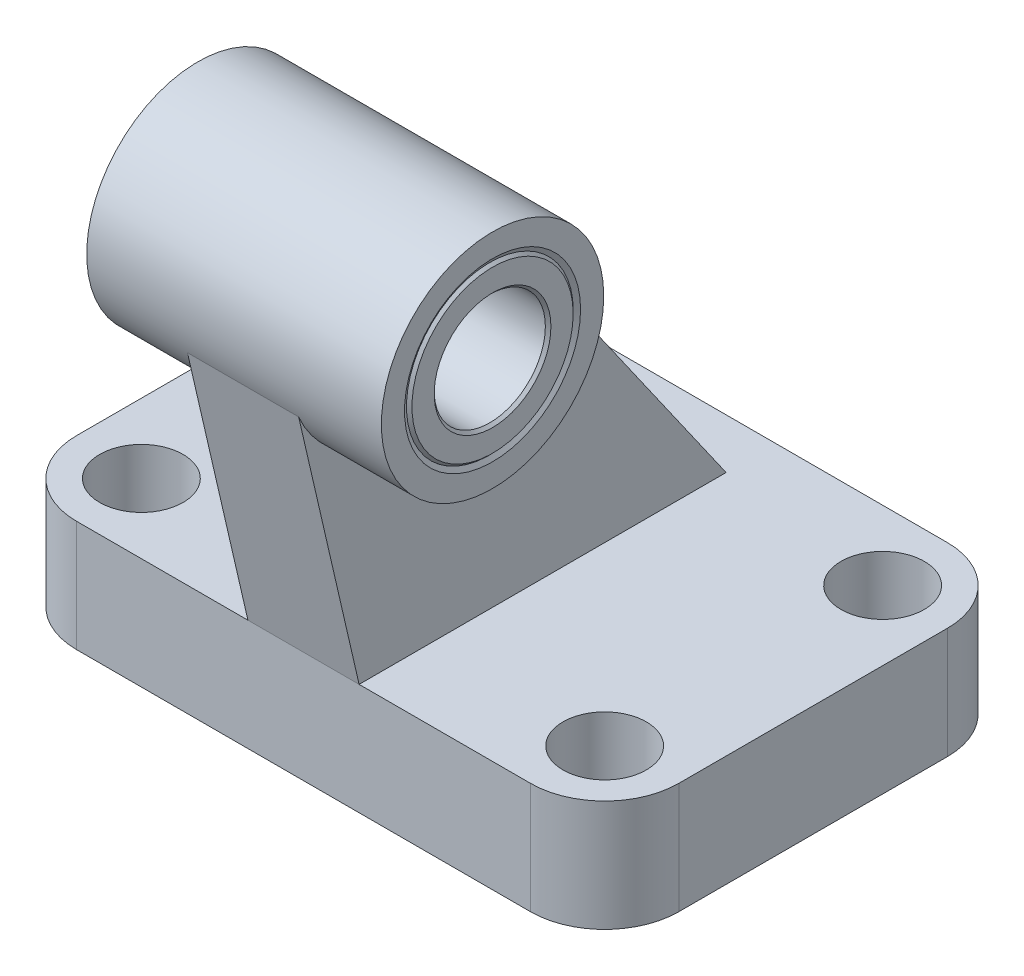
ISO-10303-21;
HEADER;
FILE_DESCRIPTION(('STEP AP214'),'2;1');
FILE_NAME('part.step','',(''),(''),'','','');
FILE_SCHEMA(('AUTOMOTIVE_DESIGN { 1 0 10303 214 1 1 1 1 }'));
ENDSEC;
DATA;
#1=APPLICATION_CONTEXT('core data for automotive mechanical design processes');
#2=APPLICATION_PROTOCOL_DEFINITION('international standard','automotive_design',2000,#1);
#3=PRODUCT_CONTEXT('',#1,'mechanical');
#4=PRODUCT('Part','Part','',(#3));
#5=PRODUCT_RELATED_PRODUCT_CATEGORY('part','',(#4));
#6=PRODUCT_DEFINITION_FORMATION('','',#4);
#7=PRODUCT_DEFINITION_CONTEXT('part definition',#1,'design');
#8=PRODUCT_DEFINITION('design','',#6,#7);
#9=PRODUCT_DEFINITION_SHAPE('','',#8);
#10=(LENGTH_UNIT() NAMED_UNIT(*) SI_UNIT(.MILLI.,.METRE.));
#11=(NAMED_UNIT(*) PLANE_ANGLE_UNIT() SI_UNIT($,.RADIAN.));
#12=(NAMED_UNIT(*) SI_UNIT($,.STERADIAN.) SOLID_ANGLE_UNIT());
#13=UNCERTAINTY_MEASURE_WITH_UNIT(LENGTH_MEASURE(1.E-05),#10,'distance_accuracy_value','');
#14=(GEOMETRIC_REPRESENTATION_CONTEXT(3) GLOBAL_UNCERTAINTY_ASSIGNED_CONTEXT((#13)) GLOBAL_UNIT_ASSIGNED_CONTEXT((#10,
#11,#12)) REPRESENTATION_CONTEXT('',''));
#15=CARTESIAN_POINT('',(0.,0.,0.));
#16=DIRECTION('',(0.,0.,1.));
#17=DIRECTION('',(1.,0.,0.));
#18=AXIS2_PLACEMENT_3D('',#15,#16,#17);
#19=CARTESIAN_POINT('',(15.9,45.,18.));
#20=DIRECTION('',(1.,0.,0.));
#21=DIRECTION('',(0.,0.,-1.));
#22=AXIS2_PLACEMENT_3D('',#19,#20,#21);
#23=CYLINDRICAL_SURFACE('',#22,9.);
#24=CARTESIAN_POINT('',(15.6,45.,18.));
#25=DIRECTION('',(1.,0.,0.));
#26=DIRECTION('',(0.,0.,-1.));
#27=AXIS2_PLACEMENT_3D('',#24,#25,#26);
#28=CIRCLE('',#27,9.);
#29=CARTESIAN_POINT('',(15.6,45.,9.));
#30=VERTEX_POINT('',#29);
#31=EDGE_CURVE('E512',#30,#30,#28,.T.);
#32=ORIENTED_EDGE('',*,*,#31,.F.);
#33=EDGE_LOOP('',(#32));
#34=FACE_BOUND('',#33,.T.);
#35=CARTESIAN_POINT('',(15.6113248654052,45.,18.));
#36=DIRECTION('',(1.,0.,0.));
#37=DIRECTION('',(0.,0.,-1.));
#38=AXIS2_PLACEMENT_3D('',#35,#36,#37);
#39=CIRCLE('',#38,9.);
#40=CARTESIAN_POINT('',(15.6113248654052,45.,9.));
#41=VERTEX_POINT('',#40);
#42=EDGE_CURVE('E303',#41,#41,#39,.T.);
#43=ORIENTED_EDGE('',*,*,#42,.T.);
#44=EDGE_LOOP('',(#43));
#45=FACE_BOUND('',#44,.T.);
#46=ADVANCED_FACE('F32',(#34,#45),#23,.F.);
#47=CARTESIAN_POINT('',(6.,42.3437666836608,29.5054105261929));
#48=DIRECTION('',(0.,0.224951054343865,-0.974370064785235));
#49=DIRECTION('',(0.,0.974370064785235,0.224951054343865));
#50=AXIS2_PLACEMENT_3D('',#47,#48,#49);
#51=PLANE('',#50);
#52=DIRECTION('',(-1.,0.,0.));
#53=VECTOR('',#52,1.);
#54=CARTESIAN_POINT('',(15.9,40.2608120616612,29.0245225604152));
#55=LINE('',#54,#53);
#56=CARTESIAN_POINT('',(-6.,40.2608120616613,29.0245225604152));
#57=VERTEX_POINT('',#56);
#58=CARTESIAN_POINT('',(6.,40.2608120616613,29.0245225604152));
#59=VERTEX_POINT('',#58);
#60=EDGE_CURVE('E132',#57,#59,#55,.F.);
#61=ORIENTED_EDGE('',*,*,#60,.F.);
#62=DIRECTION('',(0.,-0.974370064785235,-0.224951054343865));
#63=VECTOR('',#62,1.);
#64=CARTESIAN_POINT('',(-6.,42.3437666836608,29.5054105261929));
#65=LINE('',#64,#63);
#66=CARTESIAN_POINT('',(-6.,12.,22.5));
#67=VERTEX_POINT('',#66);
#68=EDGE_CURVE('E122',#57,#67,#65,.T.);
#69=ORIENTED_EDGE('',*,*,#68,.T.);
#70=DIRECTION('',(-1.,0.,0.));
#71=VECTOR('',#70,1.);
#72=CARTESIAN_POINT('',(6.,12.,22.5));
#73=LINE('',#72,#71);
#74=CARTESIAN_POINT('',(6.,12.,22.5));
#75=VERTEX_POINT('',#74);
#76=EDGE_CURVE('E159',#75,#67,#73,.T.);
#77=ORIENTED_EDGE('',*,*,#76,.F.);
#78=DIRECTION('',(0.,-0.974370064785235,-0.224951054343865));
#79=VECTOR('',#78,1.);
#80=CARTESIAN_POINT('',(6.,42.3437666836608,29.5054105261929));
#81=LINE('',#80,#79);
#82=EDGE_CURVE('E134',#59,#75,#81,.T.);
#83=ORIENTED_EDGE('',*,*,#82,.F.);
#84=EDGE_LOOP('',(#61,#69,#77,#83));
#85=FACE_BOUND('',#84,.T.);
#86=ADVANCED_FACE('F133',(#85),#51,.F.);
#87=CARTESIAN_POINT('',(6.,12.,-17.1068487609204));
#88=DIRECTION('',(0.,-0.573576436351046,0.819152044288992));
#89=DIRECTION('',(0.,-0.819152044288992,-0.573576436351046));
#90=AXIS2_PLACEMENT_3D('',#87,#88,#89);
#91=PLANE('',#90);
#92=DIRECTION('',(-1.,0.,0.));
#93=VECTOR('',#92,1.);
#94=CARTESIAN_POINT('',(15.9,45.,6.));
#95=LINE('',#94,#93);
#96=CARTESIAN_POINT('',(6.,45.,6.));
#97=VERTEX_POINT('',#96);
#98=CARTESIAN_POINT('',(-6.,45.,6.));
#99=VERTEX_POINT('',#98);
#100=EDGE_CURVE('E47',#97,#99,#95,.T.);
#101=ORIENTED_EDGE('',*,*,#100,.F.);
#102=DIRECTION('',(0.,0.819152044288992,0.573576436351046));
#103=VECTOR('',#102,1.);
#104=CARTESIAN_POINT('',(6.,12.,-17.1068487609204));
#105=LINE('',#104,#103);
#106=CARTESIAN_POINT('',(6.,12.,-17.1068487609204));
#107=VERTEX_POINT('',#106);
#108=EDGE_CURVE('E154',#107,#97,#105,.T.);
#109=ORIENTED_EDGE('',*,*,#108,.F.);
#110=DIRECTION('',(-1.,0.,0.));
#111=VECTOR('',#110,1.);
#112=CARTESIAN_POINT('',(6.,12.,-17.1068487609204));
#113=LINE('',#112,#111);
#114=CARTESIAN_POINT('',(-6.,12.,-17.1068487609204));
#115=VERTEX_POINT('',#114);
#116=EDGE_CURVE('E156',#107,#115,#113,.T.);
#117=ORIENTED_EDGE('',*,*,#116,.T.);
#118=DIRECTION('',(0.,0.819152044288992,0.573576436351046));
#119=VECTOR('',#118,1.);
#120=CARTESIAN_POINT('',(-6.,12.,-17.1068487609204));
#121=LINE('',#120,#119);
#122=EDGE_CURVE('E148',#115,#99,#121,.T.);
#123=ORIENTED_EDGE('',*,*,#122,.T.);
#124=EDGE_LOOP('',(#101,#109,#117,#123));
#125=FACE_BOUND('',#124,.T.);
#126=ADVANCED_FACE('F276',(#125),#91,.F.);
#127=CARTESIAN_POINT('',(-24.5000000000001,12.,14.5000000000001));
#128=DIRECTION('',(0.,1.,0.));
#129=DIRECTION('',(0.,0.,1.));
#130=AXIS2_PLACEMENT_3D('',#127,#128,#129);
#131=PLANE('',#130);
#132=CARTESIAN_POINT('',(25.,12.,-15.));
#133=DIRECTION('',(0.,1.,0.));
#134=DIRECTION('',(0.,0.,1.));
#135=AXIS2_PLACEMENT_3D('',#132,#133,#134);
#136=CIRCLE('',#135,4.5);
#137=CARTESIAN_POINT('',(25.,12.,-10.5));
#138=VERTEX_POINT('',#137);
#139=EDGE_CURVE('E306',#138,#138,#136,.T.);
#140=ORIENTED_EDGE('',*,*,#139,.F.);
#141=EDGE_LOOP('',(#140));
#142=FACE_BOUND('',#141,.T.);
#143=CARTESIAN_POINT('',(-25.,12.,-15.));
#144=DIRECTION('',(0.,1.,0.));
#145=DIRECTION('',(0.,0.,1.));
#146=AXIS2_PLACEMENT_3D('',#143,#144,#145);
#147=CIRCLE('',#146,4.5);
#148=CARTESIAN_POINT('',(-25.,12.,-10.5));
#149=VERTEX_POINT('',#148);
#150=EDGE_CURVE('E318',#149,#149,#147,.T.);
#151=ORIENTED_EDGE('',*,*,#150,.F.);
#152=EDGE_LOOP('',(#151));
#153=FACE_BOUND('',#152,.T.);
#154=CARTESIAN_POINT('',(25.,12.,15.));
#155=DIRECTION('',(0.,1.,0.));
#156=DIRECTION('',(0.,0.,1.));
#157=AXIS2_PLACEMENT_3D('',#154,#155,#156);
#158=CIRCLE('',#157,4.5);
#159=CARTESIAN_POINT('',(25.,12.,19.5));
#160=VERTEX_POINT('',#159);
#161=EDGE_CURVE('E324',#160,#160,#158,.T.);
#162=ORIENTED_EDGE('',*,*,#161,.F.);
#163=EDGE_LOOP('',(#162));
#164=FACE_BOUND('',#163,.T.);
#165=CARTESIAN_POINT('',(-25.,12.,15.));
#166=DIRECTION('',(0.,1.,0.));
#167=DIRECTION('',(0.,0.,1.));
#168=AXIS2_PLACEMENT_3D('',#165,#166,#167);
#169=CIRCLE('',#168,4.5);
#170=CARTESIAN_POINT('',(-25.,12.,19.5));
#171=VERTEX_POINT('',#170);
#172=EDGE_CURVE('E330',#171,#171,#169,.T.);
#173=ORIENTED_EDGE('',*,*,#172,.F.);
#174=EDGE_LOOP('',(#173));
#175=FACE_BOUND('',#174,.T.);
#176=DIRECTION('',(1.,0.,0.));
#177=VECTOR('',#176,1.);
#178=CARTESIAN_POINT('',(-24.5,12.,22.5));
#179=LINE('',#178,#177);
#180=CARTESIAN_POINT('',(-24.5,12.,22.5));
#181=VERTEX_POINT('',#180);
#182=EDGE_CURVE('E167',#181,#67,#179,.T.);
#183=ORIENTED_EDGE('',*,*,#182,.T.);
#184=DIRECTION('',(0.,0.,-1.));
#185=VECTOR('',#184,1.);
#186=CARTESIAN_POINT('',(-6.,12.,22.5));
#187=LINE('',#186,#185);
#188=EDGE_CURVE('E126',#67,#115,#187,.T.);
#189=ORIENTED_EDGE('',*,*,#188,.T.);
#190=ORIENTED_EDGE('',*,*,#116,.F.);
#191=DIRECTION('',(0.,0.,-1.));
#192=VECTOR('',#191,1.);
#193=CARTESIAN_POINT('',(6.,12.,22.5));
#194=LINE('',#193,#192);
#195=EDGE_CURVE('E151',#75,#107,#194,.T.);
#196=ORIENTED_EDGE('',*,*,#195,.F.);
#197=CARTESIAN_POINT('',(24.5,12.,22.5));
#198=VERTEX_POINT('',#197);
#199=EDGE_CURVE('E165',#75,#198,#179,.T.);
#200=ORIENTED_EDGE('',*,*,#199,.T.);
#201=CARTESIAN_POINT('',(24.5000000000001,12.,14.5000000000001));
#202=DIRECTION('',(0.,1.,0.));
#203=DIRECTION('',(0.,0.,1.));
#204=AXIS2_PLACEMENT_3D('',#201,#202,#203);
#205=CIRCLE('',#204,7.99999999999993);
#206=CARTESIAN_POINT('',(32.5,12.,14.5));
#207=VERTEX_POINT('',#206);
#208=EDGE_CURVE('E170',#198,#207,#205,.T.);
#209=ORIENTED_EDGE('',*,*,#208,.T.);
#210=DIRECTION('',(0.,0.,-1.));
#211=VECTOR('',#210,1.);
#212=CARTESIAN_POINT('',(32.5,12.,14.5));
#213=LINE('',#212,#211);
#214=CARTESIAN_POINT('',(32.5,12.,-14.5));
#215=VERTEX_POINT('',#214);
#216=EDGE_CURVE('E172',#207,#215,#213,.T.);
#217=ORIENTED_EDGE('',*,*,#216,.T.);
#218=CARTESIAN_POINT('',(24.5000000000001,12.,-14.5000000000001));
#219=DIRECTION('',(0.,1.,0.));
#220=DIRECTION('',(0.,0.,1.));
#221=AXIS2_PLACEMENT_3D('',#218,#219,#220);
#222=CIRCLE('',#221,7.99999999999993);
#223=CARTESIAN_POINT('',(24.5,12.,-22.5));
#224=VERTEX_POINT('',#223);
#225=EDGE_CURVE('E174',#215,#224,#222,.T.);
#226=ORIENTED_EDGE('',*,*,#225,.T.);
#227=DIRECTION('',(-1.,0.,0.));
#228=VECTOR('',#227,1.);
#229=CARTESIAN_POINT('',(24.5,12.,-22.5));
#230=LINE('',#229,#228);
#231=CARTESIAN_POINT('',(-24.5,12.,-22.5));
#232=VERTEX_POINT('',#231);
#233=EDGE_CURVE('E176',#224,#232,#230,.T.);
#234=ORIENTED_EDGE('',*,*,#233,.T.);
#235=CARTESIAN_POINT('',(-24.5000000000001,12.,-14.5000000000001));
#236=DIRECTION('',(0.,1.,0.));
#237=DIRECTION('',(0.,0.,1.));
#238=AXIS2_PLACEMENT_3D('',#235,#236,#237);
#239=CIRCLE('',#238,7.99999999999993);
#240=CARTESIAN_POINT('',(-32.5,12.,-14.5));
#241=VERTEX_POINT('',#240);
#242=EDGE_CURVE('E178',#232,#241,#239,.T.);
#243=ORIENTED_EDGE('',*,*,#242,.T.);
#244=DIRECTION('',(0.,0.,1.));
#245=VECTOR('',#244,1.);
#246=CARTESIAN_POINT('',(-32.5,12.,-14.5));
#247=LINE('',#246,#245);
#248=CARTESIAN_POINT('',(-32.5,12.,14.5));
#249=VERTEX_POINT('',#248);
#250=EDGE_CURVE('E180',#241,#249,#247,.T.);
#251=ORIENTED_EDGE('',*,*,#250,.T.);
#252=CARTESIAN_POINT('',(-24.5000000000001,12.,14.5000000000001));
#253=DIRECTION('',(0.,1.,0.));
#254=DIRECTION('',(0.,0.,1.));
#255=AXIS2_PLACEMENT_3D('',#252,#253,#254);
#256=CIRCLE('',#255,7.99999999999993);
#257=EDGE_CURVE('E162',#249,#181,#256,.T.);
#258=ORIENTED_EDGE('',*,*,#257,.T.);
#259=EDGE_LOOP('',(#183,#189,#190,#196,#200,#209,#217,#226,#234,#243,#251,#258));
#260=FACE_BOUND('',#259,.T.);
#261=ADVANCED_FACE('F243',(#142,#153,#164,#175,#260),#131,.T.);
#262=CARTESIAN_POINT('',(-24.5000000000001,12.,14.5000000000001));
#263=DIRECTION('',(0.,-1.,0.));
#264=DIRECTION('',(0.,0.,-1.));
#265=AXIS2_PLACEMENT_3D('',#262,#263,#264);
#266=CYLINDRICAL_SURFACE('',#265,7.99999999999993);
#267=CARTESIAN_POINT('',(-24.5000000000001,0.,14.5000000000001));
#268=DIRECTION('',(0.,1.,0.));
#269=DIRECTION('',(0.,0.,1.));
#270=AXIS2_PLACEMENT_3D('',#267,#268,#269);
#271=CIRCLE('',#270,7.99999999999993);
#272=CARTESIAN_POINT('',(-32.5,0.,14.5));
#273=VERTEX_POINT('',#272);
#274=CARTESIAN_POINT('',(-24.5,0.,22.5));
#275=VERTEX_POINT('',#274);
#276=EDGE_CURVE('E161',#273,#275,#271,.T.);
#277=ORIENTED_EDGE('',*,*,#276,.T.);
#278=DIRECTION('',(0.,-1.,0.));
#279=VECTOR('',#278,1.);
#280=CARTESIAN_POINT('',(-24.5,12.,22.5));
#281=LINE('',#280,#279);
#282=EDGE_CURVE('E40',#181,#275,#281,.T.);
#283=ORIENTED_EDGE('',*,*,#282,.F.);
#284=ORIENTED_EDGE('',*,*,#257,.F.);
#285=DIRECTION('',(0.,-1.,0.));
#286=VECTOR('',#285,1.);
#287=CARTESIAN_POINT('',(-32.5,12.,14.5));
#288=LINE('',#287,#286);
#289=EDGE_CURVE('E182',#249,#273,#288,.T.);
#290=ORIENTED_EDGE('',*,*,#289,.T.);
#291=EDGE_LOOP('',(#277,#283,#284,#290));
#292=FACE_BOUND('',#291,.T.);
#293=ADVANCED_FACE('F34',(#292),#266,.T.);
#294=CARTESIAN_POINT('',(-24.5,12.,22.5));
#295=DIRECTION('',(0.,0.,-1.));
#296=DIRECTION('',(-1.,0.,0.));
#297=AXIS2_PLACEMENT_3D('',#294,#295,#296);
#298=PLANE('',#297);
#299=DIRECTION('',(1.,0.,0.));
#300=VECTOR('',#299,1.);
#301=CARTESIAN_POINT('',(-24.5,0.,22.5));
#302=LINE('',#301,#300);
#303=CARTESIAN_POINT('',(24.5,0.,22.5));
#304=VERTEX_POINT('',#303);
#305=EDGE_CURVE('E185',#275,#304,#302,.T.);
#306=ORIENTED_EDGE('',*,*,#305,.T.);
#307=DIRECTION('',(0.,-1.,0.));
#308=VECTOR('',#307,1.);
#309=CARTESIAN_POINT('',(24.5,12.,22.5));
#310=LINE('',#309,#308);
#311=EDGE_CURVE('E215',#198,#304,#310,.T.);
#312=ORIENTED_EDGE('',*,*,#311,.F.);
#313=ORIENTED_EDGE('',*,*,#199,.F.);
#314=ORIENTED_EDGE('',*,*,#76,.T.);
#315=ORIENTED_EDGE('',*,*,#182,.F.);
#316=ORIENTED_EDGE('',*,*,#282,.T.);
#317=EDGE_LOOP('',(#306,#312,#313,#314,#315,#316));
#318=FACE_BOUND('',#317,.T.);
#319=ADVANCED_FACE('F220',(#318),#298,.F.);
#320=CARTESIAN_POINT('',(24.5000000000001,12.,14.5000000000001));
#321=DIRECTION('',(0.,-1.,0.));
#322=DIRECTION('',(0.,0.,-1.));
#323=AXIS2_PLACEMENT_3D('',#320,#321,#322);
#324=CYLINDRICAL_SURFACE('',#323,7.99999999999993);
#325=CARTESIAN_POINT('',(24.5000000000001,0.,14.5000000000001));
#326=DIRECTION('',(0.,1.,0.));
#327=DIRECTION('',(0.,0.,1.));
#328=AXIS2_PLACEMENT_3D('',#325,#326,#327);
#329=CIRCLE('',#328,7.99999999999993);
#330=CARTESIAN_POINT('',(32.5,0.,14.5));
#331=VERTEX_POINT('',#330);
#332=EDGE_CURVE('E187',#304,#331,#329,.T.);
#333=ORIENTED_EDGE('',*,*,#332,.T.);
#334=DIRECTION('',(0.,-1.,0.));
#335=VECTOR('',#334,1.);
#336=CARTESIAN_POINT('',(32.5,12.,14.5));
#337=LINE('',#336,#335);
#338=EDGE_CURVE('E212',#207,#331,#337,.T.);
#339=ORIENTED_EDGE('',*,*,#338,.F.);
#340=ORIENTED_EDGE('',*,*,#208,.F.);
#341=ORIENTED_EDGE('',*,*,#311,.T.);
#342=EDGE_LOOP('',(#333,#339,#340,#341));
#343=FACE_BOUND('',#342,.T.);
#344=ADVANCED_FACE('F235',(#343),#324,.T.);
#345=CARTESIAN_POINT('',(32.5,12.,14.5));
#346=DIRECTION('',(-1.,0.,0.));
#347=DIRECTION('',(0.,0.,1.));
#348=AXIS2_PLACEMENT_3D('',#345,#346,#347);
#349=PLANE('',#348);
#350=DIRECTION('',(0.,0.,-1.));
#351=VECTOR('',#350,1.);
#352=CARTESIAN_POINT('',(32.5,0.,14.5));
#353=LINE('',#352,#351);
#354=CARTESIAN_POINT('',(32.5,0.,-14.5));
#355=VERTEX_POINT('',#354);
#356=EDGE_CURVE('E189',#331,#355,#353,.T.);
#357=ORIENTED_EDGE('',*,*,#356,.T.);
#358=DIRECTION('',(0.,-1.,0.));
#359=VECTOR('',#358,1.);
#360=CARTESIAN_POINT('',(32.5,12.,-14.5));
#361=LINE('',#360,#359);
#362=EDGE_CURVE('E209',#215,#355,#361,.T.);
#363=ORIENTED_EDGE('',*,*,#362,.F.);
#364=ORIENTED_EDGE('',*,*,#216,.F.);
#365=ORIENTED_EDGE('',*,*,#338,.T.);
#366=EDGE_LOOP('',(#357,#363,#364,#365));
#367=FACE_BOUND('',#366,.T.);
#368=ADVANCED_FACE('F239',(#367),#349,.F.);
#369=CARTESIAN_POINT('',(24.5000000000001,12.,-14.5000000000001));
#370=DIRECTION('',(0.,-1.,0.));
#371=DIRECTION('',(0.,0.,-1.));
#372=AXIS2_PLACEMENT_3D('',#369,#370,#371);
#373=CYLINDRICAL_SURFACE('',#372,7.99999999999993);
#374=CARTESIAN_POINT('',(24.5000000000001,0.,-14.5000000000001));
#375=DIRECTION('',(0.,1.,0.));
#376=DIRECTION('',(0.,0.,1.));
#377=AXIS2_PLACEMENT_3D('',#374,#375,#376);
#378=CIRCLE('',#377,7.99999999999993);
#379=CARTESIAN_POINT('',(24.5,0.,-22.5));
#380=VERTEX_POINT('',#379);
#381=EDGE_CURVE('E191',#355,#380,#378,.T.);
#382=ORIENTED_EDGE('',*,*,#381,.T.);
#383=DIRECTION('',(0.,-1.,0.));
#384=VECTOR('',#383,1.);
#385=CARTESIAN_POINT('',(24.5,12.,-22.5));
#386=LINE('',#385,#384);
#387=EDGE_CURVE('E206',#224,#380,#386,.T.);
#388=ORIENTED_EDGE('',*,*,#387,.F.);
#389=ORIENTED_EDGE('',*,*,#225,.F.);
#390=ORIENTED_EDGE('',*,*,#362,.T.);
#391=EDGE_LOOP('',(#382,#388,#389,#390));
#392=FACE_BOUND('',#391,.T.);
#393=ADVANCED_FACE('F260',(#392),#373,.T.);
#394=CARTESIAN_POINT('',(24.5,12.,-22.5));
#395=DIRECTION('',(0.,0.,1.));
#396=DIRECTION('',(1.,0.,0.));
#397=AXIS2_PLACEMENT_3D('',#394,#395,#396);
#398=PLANE('',#397);
#399=DIRECTION('',(-1.,0.,0.));
#400=VECTOR('',#399,1.);
#401=CARTESIAN_POINT('',(24.5,0.,-22.5));
#402=LINE('',#401,#400);
#403=CARTESIAN_POINT('',(-24.5,0.,-22.5));
#404=VERTEX_POINT('',#403);
#405=EDGE_CURVE('E193',#380,#404,#402,.T.);
#406=ORIENTED_EDGE('',*,*,#405,.T.);
#407=DIRECTION('',(0.,-1.,0.));
#408=VECTOR('',#407,1.);
#409=CARTESIAN_POINT('',(-24.5,12.,-22.5));
#410=LINE('',#409,#408);
#411=EDGE_CURVE('E203',#232,#404,#410,.T.);
#412=ORIENTED_EDGE('',*,*,#411,.F.);
#413=ORIENTED_EDGE('',*,*,#233,.F.);
#414=ORIENTED_EDGE('',*,*,#387,.T.);
#415=EDGE_LOOP('',(#406,#412,#413,#414));
#416=FACE_BOUND('',#415,.T.);
#417=ADVANCED_FACE('F257',(#416),#398,.F.);
#418=CARTESIAN_POINT('',(-24.5000000000001,12.,-14.5000000000001));
#419=DIRECTION('',(0.,-1.,0.));
#420=DIRECTION('',(0.,0.,-1.));
#421=AXIS2_PLACEMENT_3D('',#418,#419,#420);
#422=CYLINDRICAL_SURFACE('',#421,7.99999999999993);
#423=CARTESIAN_POINT('',(-24.5000000000001,0.,-14.5000000000001));
#424=DIRECTION('',(0.,1.,0.));
#425=DIRECTION('',(0.,0.,1.));
#426=AXIS2_PLACEMENT_3D('',#423,#424,#425);
#427=CIRCLE('',#426,7.99999999999993);
#428=CARTESIAN_POINT('',(-32.5,0.,-14.5));
#429=VERTEX_POINT('',#428);
#430=EDGE_CURVE('E195',#404,#429,#427,.T.);
#431=ORIENTED_EDGE('',*,*,#430,.T.);
#432=DIRECTION('',(0.,-1.,0.));
#433=VECTOR('',#432,1.);
#434=CARTESIAN_POINT('',(-32.5,12.,-14.5));
#435=LINE('',#434,#433);
#436=EDGE_CURVE('E200',#241,#429,#435,.T.);
#437=ORIENTED_EDGE('',*,*,#436,.F.);
#438=ORIENTED_EDGE('',*,*,#242,.F.);
#439=ORIENTED_EDGE('',*,*,#411,.T.);
#440=EDGE_LOOP('',(#431,#437,#438,#439));
#441=FACE_BOUND('',#440,.T.);
#442=ADVANCED_FACE('F253',(#441),#422,.T.);
#443=CARTESIAN_POINT('',(-32.5,12.,-14.5));
#444=DIRECTION('',(1.,0.,0.));
#445=DIRECTION('',(0.,0.,-1.));
#446=AXIS2_PLACEMENT_3D('',#443,#444,#445);
#447=PLANE('',#446);
#448=DIRECTION('',(0.,0.,1.));
#449=VECTOR('',#448,1.);
#450=CARTESIAN_POINT('',(-32.5,0.,-14.5));
#451=LINE('',#450,#449);
#452=EDGE_CURVE('E166',#429,#273,#451,.T.);
#453=ORIENTED_EDGE('',*,*,#452,.T.);
#454=ORIENTED_EDGE('',*,*,#289,.F.);
#455=ORIENTED_EDGE('',*,*,#250,.F.);
#456=ORIENTED_EDGE('',*,*,#436,.T.);
#457=EDGE_LOOP('',(#453,#454,#455,#456));
#458=FACE_BOUND('',#457,.T.);
#459=ADVANCED_FACE('F251',(#458),#447,.F.);
#460=CARTESIAN_POINT('',(-24.5000000000001,0.,14.5000000000001));
#461=DIRECTION('',(0.,1.,0.));
#462=DIRECTION('',(0.,0.,1.));
#463=AXIS2_PLACEMENT_3D('',#460,#461,#462);
#464=PLANE('',#463);
#465=CARTESIAN_POINT('',(25.,0.,-15.));
#466=DIRECTION('',(0.,1.,0.));
#467=DIRECTION('',(0.,0.,1.));
#468=AXIS2_PLACEMENT_3D('',#465,#466,#467);
#469=CIRCLE('',#468,4.5);
#470=CARTESIAN_POINT('',(25.,0.,-10.5));
#471=VERTEX_POINT('',#470);
#472=EDGE_CURVE('E315',#471,#471,#469,.T.);
#473=ORIENTED_EDGE('',*,*,#472,.T.);
#474=EDGE_LOOP('',(#473));
#475=FACE_BOUND('',#474,.T.);
#476=CARTESIAN_POINT('',(-25.,0.,-15.));
#477=DIRECTION('',(0.,1.,0.));
#478=DIRECTION('',(0.,0.,1.));
#479=AXIS2_PLACEMENT_3D('',#476,#477,#478);
#480=CIRCLE('',#479,4.5);
#481=CARTESIAN_POINT('',(-25.,0.,-10.5));
#482=VERTEX_POINT('',#481);
#483=EDGE_CURVE('E321',#482,#482,#480,.T.);
#484=ORIENTED_EDGE('',*,*,#483,.T.);
#485=EDGE_LOOP('',(#484));
#486=FACE_BOUND('',#485,.T.);
#487=CARTESIAN_POINT('',(25.,0.,15.));
#488=DIRECTION('',(0.,1.,0.));
#489=DIRECTION('',(0.,0.,1.));
#490=AXIS2_PLACEMENT_3D('',#487,#488,#489);
#491=CIRCLE('',#490,4.5);
#492=CARTESIAN_POINT('',(25.,0.,19.5));
#493=VERTEX_POINT('',#492);
#494=EDGE_CURVE('E327',#493,#493,#491,.T.);
#495=ORIENTED_EDGE('',*,*,#494,.T.);
#496=EDGE_LOOP('',(#495));
#497=FACE_BOUND('',#496,.T.);
#498=CARTESIAN_POINT('',(-25.,0.,15.));
#499=DIRECTION('',(0.,1.,0.));
#500=DIRECTION('',(0.,0.,1.));
#501=AXIS2_PLACEMENT_3D('',#498,#499,#500);
#502=CIRCLE('',#501,4.5);
#503=CARTESIAN_POINT('',(-25.,0.,19.5));
#504=VERTEX_POINT('',#503);
#505=EDGE_CURVE('E333',#504,#504,#502,.T.);
#506=ORIENTED_EDGE('',*,*,#505,.T.);
#507=EDGE_LOOP('',(#506));
#508=FACE_BOUND('',#507,.T.);
#509=ORIENTED_EDGE('',*,*,#276,.F.);
#510=ORIENTED_EDGE('',*,*,#452,.F.);
#511=ORIENTED_EDGE('',*,*,#430,.F.);
#512=ORIENTED_EDGE('',*,*,#405,.F.);
#513=ORIENTED_EDGE('',*,*,#381,.F.);
#514=ORIENTED_EDGE('',*,*,#356,.F.);
#515=ORIENTED_EDGE('',*,*,#332,.F.);
#516=ORIENTED_EDGE('',*,*,#305,.F.);
#517=EDGE_LOOP('',(#509,#510,#511,#512,#513,#514,#515,#516));
#518=FACE_BOUND('',#517,.T.);
#519=ADVANCED_FACE('F228',(#475,#486,#497,#508,#518),#464,.F.);
#520=CARTESIAN_POINT('',(6.,0.,0.));
#521=DIRECTION('',(1.,0.,0.));
#522=DIRECTION('',(0.,0.,-1.));
#523=AXIS2_PLACEMENT_3D('',#520,#521,#522);
#524=PLANE('',#523);
#525=ORIENTED_EDGE('',*,*,#108,.T.);
#526=CARTESIAN_POINT('',(6.,45.,18.));
#527=DIRECTION('',(1.,0.,0.));
#528=DIRECTION('',(0.,0.,-1.));
#529=AXIS2_PLACEMENT_3D('',#526,#527,#528);
#530=CIRCLE('',#529,12.);
#531=EDGE_CURVE('E54',#97,#59,#530,.F.);
#532=ORIENTED_EDGE('',*,*,#531,.T.);
#533=ORIENTED_EDGE('',*,*,#82,.T.);
#534=ORIENTED_EDGE('',*,*,#195,.T.);
#535=EDGE_LOOP('',(#525,#532,#533,#534));
#536=FACE_BOUND('',#535,.T.);
#537=ADVANCED_FACE('F360',(#536),#524,.T.);
#538=CARTESIAN_POINT('',(-6.,0.,0.));
#539=DIRECTION('',(1.,0.,0.));
#540=DIRECTION('',(0.,0.,-1.));
#541=AXIS2_PLACEMENT_3D('',#538,#539,#540);
#542=PLANE('',#541);
#543=CARTESIAN_POINT('',(-6.,45.,18.));
#544=DIRECTION('',(1.,0.,0.));
#545=DIRECTION('',(0.,0.,-1.));
#546=AXIS2_PLACEMENT_3D('',#543,#544,#545);
#547=CIRCLE('',#546,12.);
#548=EDGE_CURVE('E11',#99,#57,#547,.F.);
#549=ORIENTED_EDGE('',*,*,#548,.F.);
#550=ORIENTED_EDGE('',*,*,#122,.F.);
#551=ORIENTED_EDGE('',*,*,#188,.F.);
#552=ORIENTED_EDGE('',*,*,#68,.F.);
#553=EDGE_LOOP('',(#549,#550,#551,#552));
#554=FACE_BOUND('',#553,.T.);
#555=ADVANCED_FACE('F124',(#554),#542,.F.);
#556=CARTESIAN_POINT('',(15.9,45.,18.));
#557=DIRECTION('',(-1.,0.,0.));
#558=DIRECTION('',(0.,0.,1.));
#559=AXIS2_PLACEMENT_3D('',#556,#557,#558);
#560=CYLINDRICAL_SURFACE('',#559,12.);
#561=ORIENTED_EDGE('',*,*,#531,.F.);
#562=ORIENTED_EDGE('',*,*,#100,.T.);
#563=ORIENTED_EDGE('',*,*,#548,.T.);
#564=ORIENTED_EDGE('',*,*,#60,.T.);
#565=EDGE_LOOP('',(#561,#562,#563,#564));
#566=FACE_BOUND('',#565,.T.);
#567=CARTESIAN_POINT('',(15.9,45.,18.));
#568=DIRECTION('',(1.,0.,0.));
#569=DIRECTION('',(0.,0.,-1.));
#570=AXIS2_PLACEMENT_3D('',#567,#568,#569);
#571=CIRCLE('',#570,12.);
#572=CARTESIAN_POINT('',(15.9,45.,6.));
#573=VERTEX_POINT('',#572);
#574=EDGE_CURVE('E139',#573,#573,#571,.T.);
#575=ORIENTED_EDGE('',*,*,#574,.F.);
#576=EDGE_LOOP('',(#575));
#577=FACE_BOUND('',#576,.T.);
#578=CARTESIAN_POINT('',(-15.9,45.,18.));
#579=DIRECTION('',(1.,0.,0.));
#580=DIRECTION('',(0.,0.,-1.));
#581=AXIS2_PLACEMENT_3D('',#578,#579,#580);
#582=CIRCLE('',#581,12.);
#583=CARTESIAN_POINT('',(-15.9,45.,6.));
#584=VERTEX_POINT('',#583);
#585=EDGE_CURVE('E142',#584,#584,#582,.T.);
#586=ORIENTED_EDGE('',*,*,#585,.T.);
#587=EDGE_LOOP('',(#586));
#588=FACE_BOUND('',#587,.T.);
#589=ADVANCED_FACE('F137',(#566,#577,#588),#560,.T.);
#590=CARTESIAN_POINT('',(15.9,45.,18.));
#591=DIRECTION('',(1.,0.,0.));
#592=DIRECTION('',(0.,0.,-1.));
#593=AXIS2_PLACEMENT_3D('',#590,#591,#592);
#594=PLANE('',#593);
#595=CARTESIAN_POINT('',(15.9,45.,18.));
#596=DIRECTION('',(1.,0.,0.));
#597=DIRECTION('',(0.,0.,-1.));
#598=AXIS2_PLACEMENT_3D('',#595,#596,#597);
#599=CIRCLE('',#598,9.5);
#600=CARTESIAN_POINT('',(15.9,45.,8.5));
#601=VERTEX_POINT('',#600);
#602=EDGE_CURVE('E309',#601,#601,#599,.T.);
#603=ORIENTED_EDGE('',*,*,#602,.F.);
#604=EDGE_LOOP('',(#603));
#605=FACE_BOUND('',#604,.T.);
#606=ORIENTED_EDGE('',*,*,#574,.T.);
#607=EDGE_LOOP('',(#606));
#608=FACE_BOUND('',#607,.T.);
#609=ADVANCED_FACE('F342',(#605,#608),#594,.T.);
#610=CARTESIAN_POINT('',(-15.9,45.,18.));
#611=DIRECTION('',(1.,0.,0.));
#612=DIRECTION('',(0.,0.,-1.));
#613=AXIS2_PLACEMENT_3D('',#610,#611,#612);
#614=PLANE('',#613);
#615=CARTESIAN_POINT('',(-15.9,45.,18.));
#616=DIRECTION('',(1.,0.,0.));
#617=DIRECTION('',(0.,0.,-1.));
#618=AXIS2_PLACEMENT_3D('',#615,#616,#617);
#619=CIRCLE('',#618,9.5);
#620=CARTESIAN_POINT('',(-15.9,45.,8.5));
#621=VERTEX_POINT('',#620);
#622=EDGE_CURVE('E302',#621,#621,#619,.T.);
#623=ORIENTED_EDGE('',*,*,#622,.T.);
#624=EDGE_LOOP('',(#623));
#625=FACE_BOUND('',#624,.T.);
#626=ORIENTED_EDGE('',*,*,#585,.F.);
#627=EDGE_LOOP('',(#626));
#628=FACE_BOUND('',#627,.T.);
#629=ADVANCED_FACE('F339',(#625,#628),#614,.F.);
#630=CARTESIAN_POINT('',(-25.,12.,15.));
#631=DIRECTION('',(0.,1.,0.));
#632=DIRECTION('',(0.,0.,1.));
#633=AXIS2_PLACEMENT_3D('',#630,#631,#632);
#634=CYLINDRICAL_SURFACE('',#633,4.5);
#635=ORIENTED_EDGE('',*,*,#505,.F.);
#636=EDGE_LOOP('',(#635));
#637=FACE_BOUND('',#636,.T.);
#638=ORIENTED_EDGE('',*,*,#172,.T.);
#639=EDGE_LOOP('',(#638));
#640=FACE_BOUND('',#639,.T.);
#641=ADVANCED_FACE('F341',(#637,#640),#634,.F.);
#642=CARTESIAN_POINT('',(25.,12.,15.));
#643=DIRECTION('',(0.,1.,0.));
#644=DIRECTION('',(0.,0.,1.));
#645=AXIS2_PLACEMENT_3D('',#642,#643,#644);
#646=CYLINDRICAL_SURFACE('',#645,4.5);
#647=ORIENTED_EDGE('',*,*,#494,.F.);
#648=EDGE_LOOP('',(#647));
#649=FACE_BOUND('',#648,.T.);
#650=ORIENTED_EDGE('',*,*,#161,.T.);
#651=EDGE_LOOP('',(#650));
#652=FACE_BOUND('',#651,.T.);
#653=ADVANCED_FACE('F349',(#649,#652),#646,.F.);
#654=CARTESIAN_POINT('',(-25.,12.,-15.));
#655=DIRECTION('',(0.,1.,0.));
#656=DIRECTION('',(0.,0.,1.));
#657=AXIS2_PLACEMENT_3D('',#654,#655,#656);
#658=CYLINDRICAL_SURFACE('',#657,4.5);
#659=ORIENTED_EDGE('',*,*,#483,.F.);
#660=EDGE_LOOP('',(#659));
#661=FACE_BOUND('',#660,.T.);
#662=ORIENTED_EDGE('',*,*,#150,.T.);
#663=EDGE_LOOP('',(#662));
#664=FACE_BOUND('',#663,.T.);
#665=ADVANCED_FACE('F550',(#661,#664),#658,.F.);
#666=CARTESIAN_POINT('',(25.,12.,-15.));
#667=DIRECTION('',(0.,1.,0.));
#668=DIRECTION('',(0.,0.,1.));
#669=AXIS2_PLACEMENT_3D('',#666,#667,#668);
#670=CYLINDRICAL_SURFACE('',#669,4.5);
#671=ORIENTED_EDGE('',*,*,#472,.F.);
#672=EDGE_LOOP('',(#671));
#673=FACE_BOUND('',#672,.T.);
#674=ORIENTED_EDGE('',*,*,#139,.T.);
#675=EDGE_LOOP('',(#674));
#676=FACE_BOUND('',#675,.T.);
#677=ADVANCED_FACE('F292',(#673,#676),#670,.F.);
#678=CARTESIAN_POINT('',(-15.6113248654052,45.,18.));
#679=DIRECTION('',(-1.,0.,0.));
#680=DIRECTION('',(0.,0.,1.));
#681=AXIS2_PLACEMENT_3D('',#678,#679,#680);
#682=CONICAL_SURFACE('',#681,9.,1.04719755119661);
#683=ORIENTED_EDGE('',*,*,#622,.F.);
#684=EDGE_LOOP('',(#683));
#685=FACE_BOUND('',#684,.T.);
#686=CARTESIAN_POINT('',(-15.6113248654052,45.,18.));
#687=DIRECTION('',(1.,0.,0.));
#688=DIRECTION('',(0.,0.,-1.));
#689=AXIS2_PLACEMENT_3D('',#686,#687,#688);
#690=CIRCLE('',#689,9.);
#691=CARTESIAN_POINT('',(-15.6113248654052,45.,9.));
#692=VERTEX_POINT('',#691);
#693=EDGE_CURVE('E300',#692,#692,#690,.T.);
#694=ORIENTED_EDGE('',*,*,#693,.T.);
#695=EDGE_LOOP('',(#694));
#696=FACE_BOUND('',#695,.T.);
#697=ADVANCED_FACE('F284',(#685,#696),#682,.F.);
#698=CARTESIAN_POINT('',(-15.6,45.,18.));
#699=DIRECTION('',(1.,0.,0.));
#700=DIRECTION('',(0.,0.,-1.));
#701=AXIS2_PLACEMENT_3D('',#698,#699,#700);
#702=CIRCLE('',#701,9.);
#703=CARTESIAN_POINT('',(-15.6,45.,9.));
#704=VERTEX_POINT('',#703);
#705=EDGE_CURVE('E297',#704,#704,#702,.T.);
#706=ORIENTED_EDGE('',*,*,#705,.T.);
#707=EDGE_LOOP('',(#706));
#708=FACE_BOUND('',#707,.T.);
#709=ORIENTED_EDGE('',*,*,#693,.F.);
#710=EDGE_LOOP('',(#709));
#711=FACE_BOUND('',#710,.T.);
#712=ADVANCED_FACE('F272',(#708,#711),#23,.F.);
#713=CARTESIAN_POINT('',(15.9,45.,18.));
#714=DIRECTION('',(1.,0.,0.));
#715=DIRECTION('',(0.,0.,-1.));
#716=AXIS2_PLACEMENT_3D('',#713,#714,#715);
#717=CONICAL_SURFACE('',#716,9.5,1.04719755119662);
#718=ORIENTED_EDGE('',*,*,#42,.F.);
#719=EDGE_LOOP('',(#718));
#720=FACE_BOUND('',#719,.T.);
#721=ORIENTED_EDGE('',*,*,#602,.T.);
#722=EDGE_LOOP('',(#721));
#723=FACE_BOUND('',#722,.T.);
#724=ADVANCED_FACE('F283',(#720,#723),#717,.F.);
#725=CARTESIAN_POINT('',(-15.9,53.7,18.));
#726=DIRECTION('',(-1.,0.,0.));
#727=DIRECTION('',(0.,0.,1.));
#728=AXIS2_PLACEMENT_3D('',#725,#726,#727);
#729=PLANE('',#728);
#730=CARTESIAN_POINT('',(-15.9,45.,18.));
#731=DIRECTION('',(1.,0.,0.));
#732=DIRECTION('',(0.,0.,-1.));
#733=AXIS2_PLACEMENT_3D('',#730,#731,#732);
#734=CIRCLE('',#733,6.3);
#735=CARTESIAN_POINT('',(-15.9,45.,11.7));
#736=VERTEX_POINT('',#735);
#737=EDGE_CURVE('E530',#736,#736,#734,.T.);
#738=ORIENTED_EDGE('',*,*,#737,.T.);
#739=EDGE_LOOP('',(#738));
#740=FACE_BOUND('',#739,.T.);
#741=CARTESIAN_POINT('',(-15.9,45.,18.));
#742=DIRECTION('',(1.,0.,0.));
#743=DIRECTION('',(0.,0.,-1.));
#744=AXIS2_PLACEMENT_3D('',#741,#742,#743);
#745=CIRCLE('',#744,8.7);
#746=CARTESIAN_POINT('',(-15.9,45.,9.3));
#747=VERTEX_POINT('',#746);
#748=EDGE_CURVE('E511',#747,#747,#745,.T.);
#749=ORIENTED_EDGE('',*,*,#748,.F.);
#750=EDGE_LOOP('',(#749));
#751=FACE_BOUND('',#750,.T.);
#752=ADVANCED_FACE('F290',(#740,#751),#729,.T.);
#753=CARTESIAN_POINT('',(-15.9,45.,18.));
#754=DIRECTION('',(-1.,0.,0.));
#755=DIRECTION('',(0.,0.,1.));
#756=AXIS2_PLACEMENT_3D('',#753,#754,#755);
#757=CONICAL_SURFACE('',#756,6.3,0.785398163397448);
#758=CARTESIAN_POINT('',(-15.6,45.,18.));
#759=DIRECTION('',(1.,0.,0.));
#760=DIRECTION('',(0.,0.,-1.));
#761=AXIS2_PLACEMENT_3D('',#758,#759,#760);
#762=CIRCLE('',#761,6.);
#763=CARTESIAN_POINT('',(-15.6,45.,12.));
#764=VERTEX_POINT('',#763);
#765=EDGE_CURVE('E527',#764,#764,#762,.T.);
#766=ORIENTED_EDGE('',*,*,#765,.T.);
#767=EDGE_LOOP('',(#766));
#768=FACE_BOUND('',#767,.T.);
#769=ORIENTED_EDGE('',*,*,#737,.F.);
#770=EDGE_LOOP('',(#769));
#771=FACE_BOUND('',#770,.T.);
#772=ADVANCED_FACE('F444',(#768,#771),#757,.F.);
#773=CARTESIAN_POINT('',(15.9,45.,18.));
#774=DIRECTION('',(1.,0.,0.));
#775=DIRECTION('',(0.,0.,-1.));
#776=AXIS2_PLACEMENT_3D('',#773,#774,#775);
#777=CYLINDRICAL_SURFACE('',#776,6.);
#778=CARTESIAN_POINT('',(15.6,45.,18.));
#779=DIRECTION('',(1.,0.,0.));
#780=DIRECTION('',(0.,0.,-1.));
#781=AXIS2_PLACEMENT_3D('',#778,#779,#780);
#782=CIRCLE('',#781,6.);
#783=CARTESIAN_POINT('',(15.6,45.,12.));
#784=VERTEX_POINT('',#783);
#785=EDGE_CURVE('E524',#784,#784,#782,.T.);
#786=ORIENTED_EDGE('',*,*,#785,.T.);
#787=EDGE_LOOP('',(#786));
#788=FACE_BOUND('',#787,.T.);
#789=ORIENTED_EDGE('',*,*,#765,.F.);
#790=EDGE_LOOP('',(#789));
#791=FACE_BOUND('',#790,.T.);
#792=ADVANCED_FACE('F454',(#788,#791),#777,.F.);
#793=CARTESIAN_POINT('',(15.6,45.,18.));
#794=DIRECTION('',(1.,0.,0.));
#795=DIRECTION('',(0.,0.,-1.));
#796=AXIS2_PLACEMENT_3D('',#793,#794,#795);
#797=CONICAL_SURFACE('',#796,6.,0.785398163397448);
#798=CARTESIAN_POINT('',(15.9,45.,18.));
#799=DIRECTION('',(1.,0.,0.));
#800=DIRECTION('',(0.,0.,-1.));
#801=AXIS2_PLACEMENT_3D('',#798,#799,#800);
#802=CIRCLE('',#801,6.3);
#803=CARTESIAN_POINT('',(15.9,45.,11.7));
#804=VERTEX_POINT('',#803);
#805=EDGE_CURVE('E521',#804,#804,#802,.T.);
#806=ORIENTED_EDGE('',*,*,#805,.T.);
#807=EDGE_LOOP('',(#806));
#808=FACE_BOUND('',#807,.T.);
#809=ORIENTED_EDGE('',*,*,#785,.F.);
#810=EDGE_LOOP('',(#809));
#811=FACE_BOUND('',#810,.T.);
#812=ADVANCED_FACE('F464',(#808,#811),#797,.F.);
#813=CARTESIAN_POINT('',(15.9,51.3,18.));
#814=DIRECTION('',(1.,0.,0.));
#815=DIRECTION('',(0.,0.,-1.));
#816=AXIS2_PLACEMENT_3D('',#813,#814,#815);
#817=PLANE('',#816);
#818=CARTESIAN_POINT('',(15.9,45.,18.));
#819=DIRECTION('',(1.,0.,0.));
#820=DIRECTION('',(0.,0.,-1.));
#821=AXIS2_PLACEMENT_3D('',#818,#819,#820);
#822=CIRCLE('',#821,8.7);
#823=CARTESIAN_POINT('',(15.9,45.,9.3));
#824=VERTEX_POINT('',#823);
#825=EDGE_CURVE('E515',#824,#824,#822,.T.);
#826=ORIENTED_EDGE('',*,*,#825,.T.);
#827=EDGE_LOOP('',(#826));
#828=FACE_BOUND('',#827,.T.);
#829=ORIENTED_EDGE('',*,*,#805,.F.);
#830=EDGE_LOOP('',(#829));
#831=FACE_BOUND('',#830,.T.);
#832=ADVANCED_FACE('F474',(#828,#831),#817,.T.);
#833=CARTESIAN_POINT('',(15.9,45.,18.));
#834=DIRECTION('',(-1.,0.,0.));
#835=DIRECTION('',(0.,0.,1.));
#836=AXIS2_PLACEMENT_3D('',#833,#834,#835);
#837=CONICAL_SURFACE('',#836,8.7,0.785398163397448);
#838=ORIENTED_EDGE('',*,*,#31,.T.);
#839=EDGE_LOOP('',(#838));
#840=FACE_BOUND('',#839,.T.);
#841=ORIENTED_EDGE('',*,*,#825,.F.);
#842=EDGE_LOOP('',(#841));
#843=FACE_BOUND('',#842,.T.);
#844=ADVANCED_FACE('F484',(#840,#843),#837,.T.);
#845=CARTESIAN_POINT('',(-15.6,45.,18.));
#846=DIRECTION('',(1.,0.,0.));
#847=DIRECTION('',(0.,0.,-1.));
#848=AXIS2_PLACEMENT_3D('',#845,#846,#847);
#849=CONICAL_SURFACE('',#848,9.,0.785398163397448);
#850=ORIENTED_EDGE('',*,*,#748,.T.);
#851=EDGE_LOOP('',(#850));
#852=FACE_BOUND('',#851,.T.);
#853=ORIENTED_EDGE('',*,*,#705,.F.);
#854=EDGE_LOOP('',(#853));
#855=FACE_BOUND('',#854,.T.);
#856=ADVANCED_FACE('F494',(#852,#855),#849,.T.);
#857=CLOSED_SHELL('',(#46,#86,#126,#261,#293,#319,#344,#368,#393,#417,#442,#459,#519,#537,#555,
#589,#609,#629,#641,#653,#665,#677,#697,#712,#724,#752,#772,#792,#812,#832,#844,#856));
#858=MANIFOLD_SOLID_BREP('B2',#857);
#859=ADVANCED_BREP_SHAPE_REPRESENTATION('',(#18,#858),#14);
#860=SHAPE_DEFINITION_REPRESENTATION(#9,#859);
ENDSEC;
END-ISO-10303-21;
